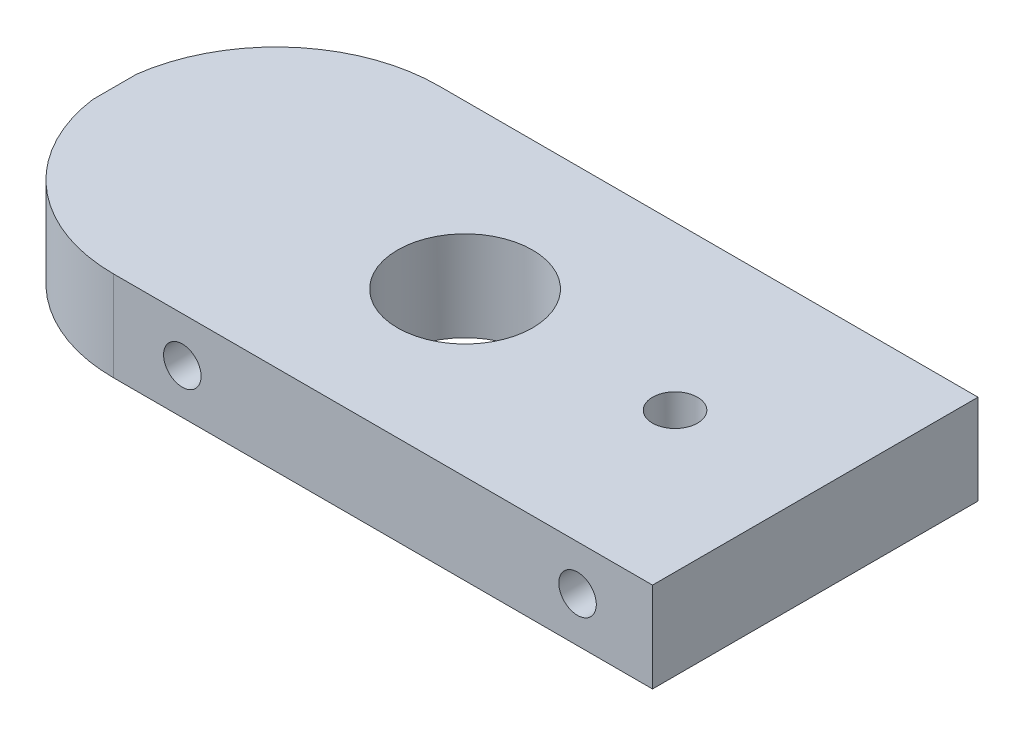
ISO-10303-21;
HEADER;
FILE_DESCRIPTION(('STEP AP214'),'2;1');
FILE_NAME('part.step','',(''),(''),'','','');
FILE_SCHEMA(('AUTOMOTIVE_DESIGN { 1 0 10303 214 1 1 1 1 }'));
ENDSEC;
DATA;
#1=APPLICATION_CONTEXT('core data for automotive mechanical design processes');
#2=APPLICATION_PROTOCOL_DEFINITION('international standard','automotive_design',2000,#1);
#3=PRODUCT_CONTEXT('',#1,'mechanical');
#4=PRODUCT('Part','Part','',(#3));
#5=PRODUCT_RELATED_PRODUCT_CATEGORY('part','',(#4));
#6=PRODUCT_DEFINITION_FORMATION('','',#4);
#7=PRODUCT_DEFINITION_CONTEXT('part definition',#1,'design');
#8=PRODUCT_DEFINITION('design','',#6,#7);
#9=PRODUCT_DEFINITION_SHAPE('','',#8);
#10=(LENGTH_UNIT() NAMED_UNIT(*) SI_UNIT(.MILLI.,.METRE.));
#11=(NAMED_UNIT(*) PLANE_ANGLE_UNIT() SI_UNIT($,.RADIAN.));
#12=(NAMED_UNIT(*) SI_UNIT($,.STERADIAN.) SOLID_ANGLE_UNIT());
#13=UNCERTAINTY_MEASURE_WITH_UNIT(LENGTH_MEASURE(1.E-05),#10,'distance_accuracy_value','');
#14=(GEOMETRIC_REPRESENTATION_CONTEXT(3) GLOBAL_UNCERTAINTY_ASSIGNED_CONTEXT((#13)) GLOBAL_UNIT_ASSIGNED_CONTEXT((#10,
#11,#12)) REPRESENTATION_CONTEXT('',''));
#15=CARTESIAN_POINT('',(0.,0.,0.));
#16=DIRECTION('',(0.,0.,1.));
#17=DIRECTION('',(1.,0.,0.));
#18=AXIS2_PLACEMENT_3D('',#15,#16,#17);
#19=CARTESIAN_POINT('',(0.,0.,10.85));
#20=DIRECTION('',(0.,0.,-1.));
#21=DIRECTION('',(-1.,0.,0.));
#22=AXIS2_PLACEMENT_3D('',#19,#20,#21);
#23=PLANE('',#22);
#24=CARTESIAN_POINT('',(-8.,615.,10.85));
#25=DIRECTION('',(0.,0.,-1.));
#26=DIRECTION('',(-1.,0.,0.));
#27=AXIS2_PLACEMENT_3D('',#24,#25,#26);
#28=CIRCLE('',#27,1.24999999999989);
#29=CARTESIAN_POINT('',(-9.24999999999989,615.,10.85));
#30=VERTEX_POINT('',#29);
#31=EDGE_CURVE('E205',#30,#30,#28,.T.);
#32=ORIENTED_EDGE('',*,*,#31,.T.);
#33=EDGE_LOOP('',(#32));
#34=FACE_BOUND('',#33,.T.);
#35=CARTESIAN_POINT('',(18.35,615.,10.85));
#36=DIRECTION('',(0.,0.,-1.));
#37=DIRECTION('',(-1.,0.,0.));
#38=AXIS2_PLACEMENT_3D('',#35,#36,#37);
#39=CIRCLE('',#38,1.2499999999999);
#40=CARTESIAN_POINT('',(17.1000000000001,615.,10.85));
#41=VERTEX_POINT('',#40);
#42=EDGE_CURVE('E162',#41,#41,#39,.T.);
#43=ORIENTED_EDGE('',*,*,#42,.T.);
#44=EDGE_LOOP('',(#43));
#45=FACE_BOUND('',#44,.T.);
#46=DIRECTION('',(0.,-1.,0.));
#47=VECTOR('',#46,1.);
#48=CARTESIAN_POINT('',(-12.6,618.,10.85));
#49=LINE('',#48,#47);
#50=CARTESIAN_POINT('',(-12.6,618.,10.85));
#51=VERTEX_POINT('',#50);
#52=CARTESIAN_POINT('',(-12.6,612.,10.85));
#53=VERTEX_POINT('',#52);
#54=EDGE_CURVE('E115',#51,#53,#49,.T.);
#55=ORIENTED_EDGE('',*,*,#54,.T.);
#56=DIRECTION('',(1.,0.,0.));
#57=VECTOR('',#56,1.);
#58=CARTESIAN_POINT('',(-23.35,612.,10.85));
#59=LINE('',#58,#57);
#60=CARTESIAN_POINT('',(23.35,612.,10.85));
#61=VERTEX_POINT('',#60);
#62=EDGE_CURVE('E136',#53,#61,#59,.T.);
#63=ORIENTED_EDGE('',*,*,#62,.T.);
#64=DIRECTION('',(0.,1.,0.));
#65=VECTOR('',#64,1.);
#66=CARTESIAN_POINT('',(23.35,612.,10.85));
#67=LINE('',#66,#65);
#68=CARTESIAN_POINT('',(23.35,618.,10.85));
#69=VERTEX_POINT('',#68);
#70=EDGE_CURVE('E134',#61,#69,#67,.T.);
#71=ORIENTED_EDGE('',*,*,#70,.T.);
#72=DIRECTION('',(-1.,0.,0.));
#73=VECTOR('',#72,1.);
#74=CARTESIAN_POINT('',(-23.35,618.,10.85));
#75=LINE('',#74,#73);
#76=EDGE_CURVE('E129',#69,#51,#75,.T.);
#77=ORIENTED_EDGE('',*,*,#76,.T.);
#78=EDGE_LOOP('',(#55,#63,#71,#77));
#79=FACE_BOUND('',#78,.T.);
#80=ADVANCED_FACE('F64',(#34,#45,#79),#23,.F.);
#81=CARTESIAN_POINT('',(0.,0.,-10.85));
#82=DIRECTION('',(0.,0.,-1.));
#83=DIRECTION('',(-1.,0.,0.));
#84=AXIS2_PLACEMENT_3D('',#81,#82,#83);
#85=PLANE('',#84);
#86=CARTESIAN_POINT('',(18.35,615.,-10.85));
#87=DIRECTION('',(0.,0.,-1.));
#88=DIRECTION('',(-1.,0.,0.));
#89=AXIS2_PLACEMENT_3D('',#86,#87,#88);
#90=CIRCLE('',#89,1.2499999999999);
#91=CARTESIAN_POINT('',(17.1000000000001,615.,-10.85));
#92=VERTEX_POINT('',#91);
#93=EDGE_CURVE('E197',#92,#92,#90,.T.);
#94=ORIENTED_EDGE('',*,*,#93,.F.);
#95=EDGE_LOOP('',(#94));
#96=FACE_BOUND('',#95,.T.);
#97=CARTESIAN_POINT('',(-8.,615.,-10.85));
#98=DIRECTION('',(0.,0.,-1.));
#99=DIRECTION('',(-1.,0.,0.));
#100=AXIS2_PLACEMENT_3D('',#97,#98,#99);
#101=CIRCLE('',#100,1.24999999999989);
#102=CARTESIAN_POINT('',(-9.24999999999989,615.,-10.85));
#103=VERTEX_POINT('',#102);
#104=EDGE_CURVE('E188',#103,#103,#101,.T.);
#105=ORIENTED_EDGE('',*,*,#104,.F.);
#106=EDGE_LOOP('',(#105));
#107=FACE_BOUND('',#106,.T.);
#108=DIRECTION('',(1.,0.,0.));
#109=VECTOR('',#108,1.);
#110=CARTESIAN_POINT('',(-23.35,612.,-10.85));
#111=LINE('',#110,#109);
#112=CARTESIAN_POINT('',(-12.6,612.,-10.85));
#113=VERTEX_POINT('',#112);
#114=CARTESIAN_POINT('',(23.35,612.,-10.85));
#115=VERTEX_POINT('',#114);
#116=EDGE_CURVE('E140',#113,#115,#111,.T.);
#117=ORIENTED_EDGE('',*,*,#116,.F.);
#118=DIRECTION('',(0.,-1.,0.));
#119=VECTOR('',#118,1.);
#120=CARTESIAN_POINT('',(-12.6,618.,-10.85));
#121=LINE('',#120,#119);
#122=CARTESIAN_POINT('',(-12.6,618.,-10.85));
#123=VERTEX_POINT('',#122);
#124=EDGE_CURVE('E123',#123,#113,#121,.T.);
#125=ORIENTED_EDGE('',*,*,#124,.F.);
#126=DIRECTION('',(-1.,0.,0.));
#127=VECTOR('',#126,1.);
#128=CARTESIAN_POINT('',(-23.35,618.,-10.85));
#129=LINE('',#128,#127);
#130=CARTESIAN_POINT('',(23.35,618.,-10.85));
#131=VERTEX_POINT('',#130);
#132=EDGE_CURVE('E170',#131,#123,#129,.T.);
#133=ORIENTED_EDGE('',*,*,#132,.F.);
#134=DIRECTION('',(0.,1.,0.));
#135=VECTOR('',#134,1.);
#136=CARTESIAN_POINT('',(23.35,612.,-10.85));
#137=LINE('',#136,#135);
#138=EDGE_CURVE('E155',#115,#131,#137,.T.);
#139=ORIENTED_EDGE('',*,*,#138,.F.);
#140=EDGE_LOOP('',(#117,#125,#133,#139));
#141=FACE_BOUND('',#140,.T.);
#142=ADVANCED_FACE('F181',(#96,#107,#141),#85,.T.);
#143=CARTESIAN_POINT('',(23.35,612.,10.85));
#144=DIRECTION('',(-1.,0.,0.));
#145=DIRECTION('',(0.,0.,1.));
#146=AXIS2_PLACEMENT_3D('',#143,#144,#145);
#147=PLANE('',#146);
#148=DIRECTION('',(0.,0.,-1.));
#149=VECTOR('',#148,1.);
#150=CARTESIAN_POINT('',(23.35,612.,10.85));
#151=LINE('',#150,#149);
#152=EDGE_CURVE('E138',#61,#115,#151,.T.);
#153=ORIENTED_EDGE('',*,*,#152,.T.);
#154=ORIENTED_EDGE('',*,*,#138,.T.);
#155=DIRECTION('',(0.,0.,-1.));
#156=VECTOR('',#155,1.);
#157=CARTESIAN_POINT('',(23.35,618.,10.85));
#158=LINE('',#157,#156);
#159=EDGE_CURVE('E13',#69,#131,#158,.T.);
#160=ORIENTED_EDGE('',*,*,#159,.F.);
#161=ORIENTED_EDGE('',*,*,#70,.F.);
#162=EDGE_LOOP('',(#153,#154,#160,#161));
#163=FACE_BOUND('',#162,.T.);
#164=ADVANCED_FACE('F66',(#163),#147,.F.);
#165=CARTESIAN_POINT('',(-23.35,618.,10.85));
#166=DIRECTION('',(0.,-1.,0.));
#167=DIRECTION('',(0.,0.,-1.));
#168=AXIS2_PLACEMENT_3D('',#165,#166,#167);
#169=PLANE('',#168);
#170=CARTESIAN_POINT('',(0.,618.,0.));
#171=DIRECTION('',(0.,-1.,0.));
#172=DIRECTION('',(0.,0.,-1.));
#173=AXIS2_PLACEMENT_3D('',#170,#171,#172);
#174=CIRCLE('',#173,4.5);
#175=CARTESIAN_POINT('',(0.,618.,-4.5));
#176=VERTEX_POINT('',#175);
#177=EDGE_CURVE('E151',#176,#176,#174,.T.);
#178=ORIENTED_EDGE('',*,*,#177,.T.);
#179=EDGE_LOOP('',(#178));
#180=FACE_BOUND('',#179,.T.);
#181=CARTESIAN_POINT('',(14.,618.,0.));
#182=DIRECTION('',(0.,-1.,0.));
#183=DIRECTION('',(0.,0.,-1.));
#184=AXIS2_PLACEMENT_3D('',#181,#182,#183);
#185=CIRCLE('',#184,1.5);
#186=CARTESIAN_POINT('',(14.,618.,-1.5));
#187=VERTEX_POINT('',#186);
#188=EDGE_CURVE('E157',#187,#187,#185,.T.);
#189=ORIENTED_EDGE('',*,*,#188,.T.);
#190=EDGE_LOOP('',(#189));
#191=FACE_BOUND('',#190,.T.);
#192=ORIENTED_EDGE('',*,*,#132,.T.);
#193=CARTESIAN_POINT('',(-12.6,618.,0.));
#194=DIRECTION('',(0.,1.,0.));
#195=DIRECTION('',(0.,0.,1.));
#196=AXIS2_PLACEMENT_3D('',#193,#194,#195);
#197=CIRCLE('',#196,10.85);
#198=CARTESIAN_POINT('',(-23.35,618.,-1.46969384566982));
#199=VERTEX_POINT('',#198);
#200=EDGE_CURVE('E89',#123,#199,#197,.T.);
#201=ORIENTED_EDGE('',*,*,#200,.T.);
#202=DIRECTION('',(0.,0.,-1.));
#203=VECTOR('',#202,1.);
#204=CARTESIAN_POINT('',(-23.35,618.,10.85));
#205=LINE('',#204,#203);
#206=CARTESIAN_POINT('',(-23.35,618.,1.46969384566981));
#207=VERTEX_POINT('',#206);
#208=EDGE_CURVE('E73',#207,#199,#205,.T.);
#209=ORIENTED_EDGE('',*,*,#208,.F.);
#210=EDGE_CURVE('E118',#207,#51,#197,.T.);
#211=ORIENTED_EDGE('',*,*,#210,.T.);
#212=ORIENTED_EDGE('',*,*,#76,.F.);
#213=ORIENTED_EDGE('',*,*,#159,.T.);
#214=EDGE_LOOP('',(#192,#201,#209,#211,#212,#213));
#215=FACE_BOUND('',#214,.T.);
#216=ADVANCED_FACE('F128',(#180,#191,#215),#169,.F.);
#217=CARTESIAN_POINT('',(-23.35,612.,10.85));
#218=DIRECTION('',(1.,0.,0.));
#219=DIRECTION('',(0.,0.,-1.));
#220=AXIS2_PLACEMENT_3D('',#217,#218,#219);
#221=PLANE('',#220);
#222=DIRECTION('',(0.,0.,-1.));
#223=VECTOR('',#222,1.);
#224=CARTESIAN_POINT('',(-23.35,612.,10.85));
#225=LINE('',#224,#223);
#226=CARTESIAN_POINT('',(-23.35,612.,1.46969384566981));
#227=VERTEX_POINT('',#226);
#228=CARTESIAN_POINT('',(-23.35,612.,-1.46969384566982));
#229=VERTEX_POINT('',#228);
#230=EDGE_CURVE('E146',#227,#229,#225,.T.);
#231=ORIENTED_EDGE('',*,*,#230,.F.);
#232=DIRECTION('',(0.,-1.,0.));
#233=VECTOR('',#232,1.);
#234=CARTESIAN_POINT('',(-23.35,618.,1.46969384566981));
#235=LINE('',#234,#233);
#236=EDGE_CURVE('E187',#227,#207,#235,.F.);
#237=ORIENTED_EDGE('',*,*,#236,.T.);
#238=ORIENTED_EDGE('',*,*,#208,.T.);
#239=DIRECTION('',(0.,-1.,0.));
#240=VECTOR('',#239,1.);
#241=CARTESIAN_POINT('',(-23.35,618.,-1.46969384566982));
#242=LINE('',#241,#240);
#243=EDGE_CURVE('E186',#199,#229,#242,.T.);
#244=ORIENTED_EDGE('',*,*,#243,.T.);
#245=EDGE_LOOP('',(#231,#237,#238,#244));
#246=FACE_BOUND('',#245,.T.);
#247=ADVANCED_FACE('F185',(#246),#221,.F.);
#248=CARTESIAN_POINT('',(-23.35,612.,10.85));
#249=DIRECTION('',(0.,1.,0.));
#250=DIRECTION('',(0.,0.,1.));
#251=AXIS2_PLACEMENT_3D('',#248,#249,#250);
#252=PLANE('',#251);
#253=CARTESIAN_POINT('',(0.,612.,0.));
#254=DIRECTION('',(0.,1.,0.));
#255=DIRECTION('',(0.,0.,1.));
#256=AXIS2_PLACEMENT_3D('',#253,#254,#255);
#257=CIRCLE('',#256,4.5);
#258=CARTESIAN_POINT('',(0.,612.,4.5));
#259=VERTEX_POINT('',#258);
#260=EDGE_CURVE('E68',#259,#259,#257,.F.);
#261=ORIENTED_EDGE('',*,*,#260,.F.);
#262=EDGE_LOOP('',(#261));
#263=FACE_BOUND('',#262,.T.);
#264=CARTESIAN_POINT('',(14.,612.,0.));
#265=DIRECTION('',(0.,1.,0.));
#266=DIRECTION('',(0.,0.,1.));
#267=AXIS2_PLACEMENT_3D('',#264,#265,#266);
#268=CIRCLE('',#267,1.5);
#269=CARTESIAN_POINT('',(14.,612.,1.5));
#270=VERTEX_POINT('',#269);
#271=EDGE_CURVE('E149',#270,#270,#268,.F.);
#272=ORIENTED_EDGE('',*,*,#271,.F.);
#273=EDGE_LOOP('',(#272));
#274=FACE_BOUND('',#273,.T.);
#275=ORIENTED_EDGE('',*,*,#62,.F.);
#276=CARTESIAN_POINT('',(-12.6,612.,0.));
#277=DIRECTION('',(0.,1.,0.));
#278=DIRECTION('',(0.,0.,1.));
#279=AXIS2_PLACEMENT_3D('',#276,#277,#278);
#280=CIRCLE('',#279,10.85);
#281=EDGE_CURVE('E81',#53,#227,#280,.F.);
#282=ORIENTED_EDGE('',*,*,#281,.T.);
#283=ORIENTED_EDGE('',*,*,#230,.T.);
#284=EDGE_CURVE('E176',#229,#113,#280,.F.);
#285=ORIENTED_EDGE('',*,*,#284,.T.);
#286=ORIENTED_EDGE('',*,*,#116,.T.);
#287=ORIENTED_EDGE('',*,*,#152,.F.);
#288=EDGE_LOOP('',(#275,#282,#283,#285,#286,#287));
#289=FACE_BOUND('',#288,.T.);
#290=ADVANCED_FACE('F175',(#263,#274,#289),#252,.F.);
#291=CARTESIAN_POINT('',(14.,608.,0.));
#292=DIRECTION('',(0.,1.,0.));
#293=DIRECTION('',(0.,0.,1.));
#294=AXIS2_PLACEMENT_3D('',#291,#292,#293);
#295=CYLINDRICAL_SURFACE('',#294,1.5);
#296=ORIENTED_EDGE('',*,*,#188,.F.);
#297=EDGE_LOOP('',(#296));
#298=FACE_BOUND('',#297,.T.);
#299=ORIENTED_EDGE('',*,*,#271,.T.);
#300=EDGE_LOOP('',(#299));
#301=FACE_BOUND('',#300,.T.);
#302=ADVANCED_FACE('F245',(#298,#301),#295,.F.);
#303=CARTESIAN_POINT('',(0.,608.,0.));
#304=DIRECTION('',(0.,1.,0.));
#305=DIRECTION('',(0.,0.,1.));
#306=AXIS2_PLACEMENT_3D('',#303,#304,#305);
#307=CYLINDRICAL_SURFACE('',#306,4.5);
#308=ORIENTED_EDGE('',*,*,#177,.F.);
#309=EDGE_LOOP('',(#308));
#310=FACE_BOUND('',#309,.T.);
#311=ORIENTED_EDGE('',*,*,#260,.T.);
#312=EDGE_LOOP('',(#311));
#313=FACE_BOUND('',#312,.T.);
#314=ADVANCED_FACE('F256',(#310,#313),#307,.F.);
#315=CARTESIAN_POINT('',(-8.,615.,4.85));
#316=DIRECTION('',(0.,0.,1.));
#317=DIRECTION('',(1.,0.,0.));
#318=AXIS2_PLACEMENT_3D('',#315,#316,#317);
#319=CYLINDRICAL_SURFACE('',#318,1.24999999999989);
#320=CARTESIAN_POINT('',(-8.,615.,4.85));
#321=DIRECTION('',(0.,0.,-1.));
#322=DIRECTION('',(-1.,0.,0.));
#323=AXIS2_PLACEMENT_3D('',#320,#321,#322);
#324=CIRCLE('',#323,1.24999999999989);
#325=CARTESIAN_POINT('',(-9.24999999999989,615.,4.85));
#326=VERTEX_POINT('',#325);
#327=EDGE_CURVE('E202',#326,#326,#324,.T.);
#328=ORIENTED_EDGE('',*,*,#327,.T.);
#329=EDGE_LOOP('',(#328));
#330=FACE_BOUND('',#329,.T.);
#331=ORIENTED_EDGE('',*,*,#31,.F.);
#332=EDGE_LOOP('',(#331));
#333=FACE_BOUND('',#332,.T.);
#334=ADVANCED_FACE('F260',(#330,#333),#319,.F.);
#335=CARTESIAN_POINT('',(-8.,615.,4.85));
#336=DIRECTION('',(0.,0.,-1.));
#337=DIRECTION('',(-1.,0.,0.));
#338=AXIS2_PLACEMENT_3D('',#335,#336,#337);
#339=PLANE('',#338);
#340=ORIENTED_EDGE('',*,*,#327,.F.);
#341=EDGE_LOOP('',(#340));
#342=FACE_BOUND('',#341,.T.);
#343=ADVANCED_FACE('F229',(#342),#339,.F.);
#344=CARTESIAN_POINT('',(18.35,615.,4.85));
#345=DIRECTION('',(0.,0.,1.));
#346=DIRECTION('',(1.,0.,0.));
#347=AXIS2_PLACEMENT_3D('',#344,#345,#346);
#348=CYLINDRICAL_SURFACE('',#347,1.2499999999999);
#349=CARTESIAN_POINT('',(18.35,615.,4.85));
#350=DIRECTION('',(0.,0.,-1.));
#351=DIRECTION('',(-1.,0.,0.));
#352=AXIS2_PLACEMENT_3D('',#349,#350,#351);
#353=CIRCLE('',#352,1.2499999999999);
#354=CARTESIAN_POINT('',(17.1000000000001,615.,4.85));
#355=VERTEX_POINT('',#354);
#356=EDGE_CURVE('E165',#355,#355,#353,.T.);
#357=ORIENTED_EDGE('',*,*,#356,.T.);
#358=EDGE_LOOP('',(#357));
#359=FACE_BOUND('',#358,.T.);
#360=ORIENTED_EDGE('',*,*,#42,.F.);
#361=EDGE_LOOP('',(#360));
#362=FACE_BOUND('',#361,.T.);
#363=ADVANCED_FACE('F215',(#359,#362),#348,.F.);
#364=CARTESIAN_POINT('',(18.35,615.,4.85));
#365=DIRECTION('',(0.,0.,-1.));
#366=DIRECTION('',(-1.,0.,0.));
#367=AXIS2_PLACEMENT_3D('',#364,#365,#366);
#368=PLANE('',#367);
#369=ORIENTED_EDGE('',*,*,#356,.F.);
#370=EDGE_LOOP('',(#369));
#371=FACE_BOUND('',#370,.T.);
#372=ADVANCED_FACE('F218',(#371),#368,.F.);
#373=CARTESIAN_POINT('',(-8.,615.,-4.85));
#374=DIRECTION('',(0.,0.,-1.));
#375=DIRECTION('',(-1.,0.,0.));
#376=AXIS2_PLACEMENT_3D('',#373,#374,#375);
#377=CYLINDRICAL_SURFACE('',#376,1.24999999999989);
#378=CARTESIAN_POINT('',(-8.,615.,-4.85));
#379=DIRECTION('',(0.,0.,-1.));
#380=DIRECTION('',(-1.,0.,0.));
#381=AXIS2_PLACEMENT_3D('',#378,#379,#380);
#382=CIRCLE('',#381,1.24999999999989);
#383=CARTESIAN_POINT('',(-9.24999999999989,615.,-4.85));
#384=VERTEX_POINT('',#383);
#385=EDGE_CURVE('E191',#384,#384,#382,.T.);
#386=ORIENTED_EDGE('',*,*,#385,.F.);
#387=EDGE_LOOP('',(#386));
#388=FACE_BOUND('',#387,.T.);
#389=ORIENTED_EDGE('',*,*,#104,.T.);
#390=EDGE_LOOP('',(#389));
#391=FACE_BOUND('',#390,.T.);
#392=ADVANCED_FACE('F220',(#388,#391),#377,.F.);
#393=CARTESIAN_POINT('',(-8.,615.,-4.85));
#394=DIRECTION('',(0.,0.,-1.));
#395=DIRECTION('',(-1.,0.,0.));
#396=AXIS2_PLACEMENT_3D('',#393,#394,#395);
#397=PLANE('',#396);
#398=ORIENTED_EDGE('',*,*,#385,.T.);
#399=EDGE_LOOP('',(#398));
#400=FACE_BOUND('',#399,.T.);
#401=ADVANCED_FACE('F226',(#400),#397,.T.);
#402=CARTESIAN_POINT('',(18.35,615.,-4.85));
#403=DIRECTION('',(0.,0.,-1.));
#404=DIRECTION('',(-1.,0.,0.));
#405=AXIS2_PLACEMENT_3D('',#402,#403,#404);
#406=CYLINDRICAL_SURFACE('',#405,1.2499999999999);
#407=CARTESIAN_POINT('',(18.35,615.,-4.85));
#408=DIRECTION('',(0.,0.,-1.));
#409=DIRECTION('',(-1.,0.,0.));
#410=AXIS2_PLACEMENT_3D('',#407,#408,#409);
#411=CIRCLE('',#410,1.2499999999999);
#412=CARTESIAN_POINT('',(17.1000000000001,615.,-4.85));
#413=VERTEX_POINT('',#412);
#414=EDGE_CURVE('E199',#413,#413,#411,.T.);
#415=ORIENTED_EDGE('',*,*,#414,.F.);
#416=EDGE_LOOP('',(#415));
#417=FACE_BOUND('',#416,.T.);
#418=ORIENTED_EDGE('',*,*,#93,.T.);
#419=EDGE_LOOP('',(#418));
#420=FACE_BOUND('',#419,.T.);
#421=ADVANCED_FACE('F277',(#417,#420),#406,.F.);
#422=CARTESIAN_POINT('',(18.35,615.,-4.85));
#423=DIRECTION('',(0.,0.,-1.));
#424=DIRECTION('',(-1.,0.,0.));
#425=AXIS2_PLACEMENT_3D('',#422,#423,#424);
#426=PLANE('',#425);
#427=ORIENTED_EDGE('',*,*,#414,.T.);
#428=EDGE_LOOP('',(#427));
#429=FACE_BOUND('',#428,.T.);
#430=ADVANCED_FACE('F280',(#429),#426,.T.);
#431=CARTESIAN_POINT('',(-12.6,618.,0.));
#432=DIRECTION('',(0.,-1.,0.));
#433=DIRECTION('',(0.,0.,-1.));
#434=AXIS2_PLACEMENT_3D('',#431,#432,#433);
#435=CYLINDRICAL_SURFACE('',#434,10.85);
#436=ORIENTED_EDGE('',*,*,#200,.F.);
#437=ORIENTED_EDGE('',*,*,#124,.T.);
#438=ORIENTED_EDGE('',*,*,#284,.F.);
#439=ORIENTED_EDGE('',*,*,#243,.F.);
#440=EDGE_LOOP('',(#436,#437,#438,#439));
#441=FACE_BOUND('',#440,.T.);
#442=ADVANCED_FACE('F282',(#441),#435,.T.);
#443=ORIENTED_EDGE('',*,*,#281,.F.);
#444=ORIENTED_EDGE('',*,*,#54,.F.);
#445=ORIENTED_EDGE('',*,*,#210,.F.);
#446=ORIENTED_EDGE('',*,*,#236,.F.);
#447=EDGE_LOOP('',(#443,#444,#445,#446));
#448=FACE_BOUND('',#447,.T.);
#449=ADVANCED_FACE('F117',(#448),#435,.T.);
#450=CLOSED_SHELL('',(#80,#142,#164,#216,#247,#290,#302,#314,#334,#343,#363,#372,#392,#401,#421,
#430,#442,#449));
#451=MANIFOLD_SOLID_BREP('B2',#450);
#452=ADVANCED_BREP_SHAPE_REPRESENTATION('',(#18,#451),#14);
#453=SHAPE_DEFINITION_REPRESENTATION(#9,#452);
ENDSEC;
END-ISO-10303-21;
